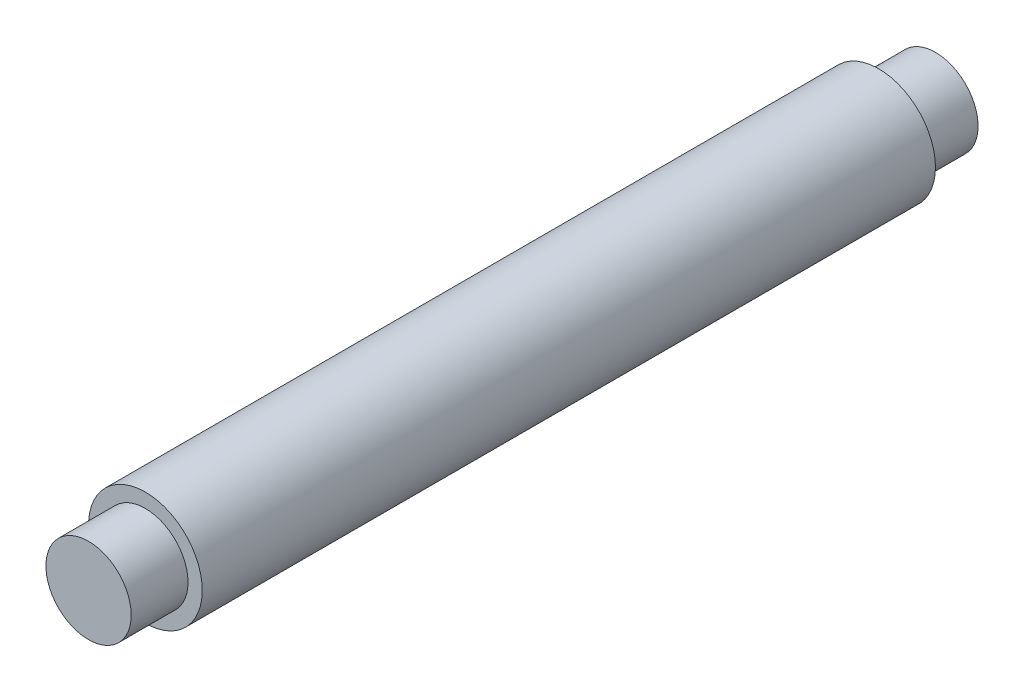
ISO-10303-21;
HEADER;
FILE_DESCRIPTION(('STEP AP214'),'2;1');
FILE_NAME('part.step','',(''),(''),'','','');
FILE_SCHEMA(('AUTOMOTIVE_DESIGN { 1 0 10303 214 1 1 1 1 }'));
ENDSEC;
DATA;
#1=APPLICATION_CONTEXT('core data for automotive mechanical design processes');
#2=APPLICATION_PROTOCOL_DEFINITION('international standard','automotive_design',2000,#1);
#3=PRODUCT_CONTEXT('',#1,'mechanical');
#4=PRODUCT('Part','Part','',(#3));
#5=PRODUCT_RELATED_PRODUCT_CATEGORY('part','',(#4));
#6=PRODUCT_DEFINITION_FORMATION('','',#4);
#7=PRODUCT_DEFINITION_CONTEXT('part definition',#1,'design');
#8=PRODUCT_DEFINITION('design','',#6,#7);
#9=PRODUCT_DEFINITION_SHAPE('','',#8);
#10=(LENGTH_UNIT() NAMED_UNIT(*) SI_UNIT(.MILLI.,.METRE.));
#11=(NAMED_UNIT(*) PLANE_ANGLE_UNIT() SI_UNIT($,.RADIAN.));
#12=(NAMED_UNIT(*) SI_UNIT($,.STERADIAN.) SOLID_ANGLE_UNIT());
#13=UNCERTAINTY_MEASURE_WITH_UNIT(LENGTH_MEASURE(1.E-05),#10,'distance_accuracy_value','');
#14=(GEOMETRIC_REPRESENTATION_CONTEXT(3) GLOBAL_UNCERTAINTY_ASSIGNED_CONTEXT((#13)) GLOBAL_UNIT_ASSIGNED_CONTEXT((#10,
#11,#12)) REPRESENTATION_CONTEXT('',''));
#15=CARTESIAN_POINT('',(0.,0.,0.));
#16=DIRECTION('',(0.,0.,1.));
#17=DIRECTION('',(1.,0.,0.));
#18=AXIS2_PLACEMENT_3D('',#15,#16,#17);
#19=CARTESIAN_POINT('',(0.,0.,258.));
#20=DIRECTION('',(0.,0.,-1.));
#21=DIRECTION('',(-1.,0.,0.));
#22=AXIS2_PLACEMENT_3D('',#19,#20,#21);
#23=CYLINDRICAL_SURFACE('',#22,20.);
#24=CARTESIAN_POINT('',(0.,0.,258.));
#25=DIRECTION('',(0.,0.,1.));
#26=DIRECTION('',(1.,0.,0.));
#27=AXIS2_PLACEMENT_3D('',#24,#25,#26);
#28=CIRCLE('',#27,20.);
#29=CARTESIAN_POINT('',(20.,0.,258.));
#30=VERTEX_POINT('',#29);
#31=EDGE_CURVE('E43',#30,#30,#28,.T.);
#32=ORIENTED_EDGE('',*,*,#31,.F.);
#33=EDGE_LOOP('',(#32));
#34=FACE_BOUND('',#33,.T.);
#35=CARTESIAN_POINT('',(0.,0.,0.));
#36=DIRECTION('',(0.,0.,1.));
#37=DIRECTION('',(1.,0.,0.));
#38=AXIS2_PLACEMENT_3D('',#35,#36,#37);
#39=CIRCLE('',#38,20.);
#40=CARTESIAN_POINT('',(20.,0.,0.));
#41=VERTEX_POINT('',#40);
#42=EDGE_CURVE('E34',#41,#41,#39,.T.);
#43=ORIENTED_EDGE('',*,*,#42,.T.);
#44=EDGE_LOOP('',(#43));
#45=FACE_BOUND('',#44,.T.);
#46=ADVANCED_FACE('F31',(#34,#45),#23,.T.);
#47=CARTESIAN_POINT('',(0.,0.,258.));
#48=DIRECTION('',(0.,0.,1.));
#49=DIRECTION('',(1.,0.,0.));
#50=AXIS2_PLACEMENT_3D('',#47,#48,#49);
#51=PLANE('',#50);
#52=CARTESIAN_POINT('',(0.,0.,258.));
#53=DIRECTION('',(0.,0.,1.));
#54=DIRECTION('',(1.,0.,0.));
#55=AXIS2_PLACEMENT_3D('',#52,#53,#54);
#56=CIRCLE('',#55,15.);
#57=CARTESIAN_POINT('',(15.,0.,258.));
#58=VERTEX_POINT('',#57);
#59=EDGE_CURVE('E38',#58,#58,#56,.T.);
#60=ORIENTED_EDGE('',*,*,#59,.F.);
#61=EDGE_LOOP('',(#60));
#62=FACE_BOUND('',#61,.T.);
#63=ORIENTED_EDGE('',*,*,#31,.T.);
#64=EDGE_LOOP('',(#63));
#65=FACE_BOUND('',#64,.T.);
#66=ADVANCED_FACE('F60',(#62,#65),#51,.T.);
#67=CARTESIAN_POINT('',(0.,0.,0.));
#68=DIRECTION('',(0.,0.,1.));
#69=DIRECTION('',(1.,0.,0.));
#70=AXIS2_PLACEMENT_3D('',#67,#68,#69);
#71=PLANE('',#70);
#72=CARTESIAN_POINT('',(0.,0.,0.));
#73=DIRECTION('',(0.,0.,-1.));
#74=DIRECTION('',(-1.,0.,0.));
#75=AXIS2_PLACEMENT_3D('',#72,#73,#74);
#76=CIRCLE('',#75,15.);
#77=CARTESIAN_POINT('',(-15.,0.,0.));
#78=VERTEX_POINT('',#77);
#79=EDGE_CURVE('E10',#78,#78,#76,.T.);
#80=ORIENTED_EDGE('',*,*,#79,.F.);
#81=EDGE_LOOP('',(#80));
#82=FACE_BOUND('',#81,.T.);
#83=ORIENTED_EDGE('',*,*,#42,.F.);
#84=EDGE_LOOP('',(#83));
#85=FACE_BOUND('',#84,.T.);
#86=ADVANCED_FACE('F57',(#82,#85),#71,.F.);
#87=CARTESIAN_POINT('',(0.,0.,278.));
#88=DIRECTION('',(0.,0.,-1.));
#89=DIRECTION('',(-1.,0.,0.));
#90=AXIS2_PLACEMENT_3D('',#87,#88,#89);
#91=CYLINDRICAL_SURFACE('',#90,15.);
#92=CARTESIAN_POINT('',(0.,0.,278.));
#93=DIRECTION('',(0.,0.,1.));
#94=DIRECTION('',(1.,0.,0.));
#95=AXIS2_PLACEMENT_3D('',#92,#93,#94);
#96=CIRCLE('',#95,15.);
#97=CARTESIAN_POINT('',(15.,0.,278.));
#98=VERTEX_POINT('',#97);
#99=EDGE_CURVE('E48',#98,#98,#96,.T.);
#100=ORIENTED_EDGE('',*,*,#99,.F.);
#101=EDGE_LOOP('',(#100));
#102=FACE_BOUND('',#101,.T.);
#103=ORIENTED_EDGE('',*,*,#59,.T.);
#104=EDGE_LOOP('',(#103));
#105=FACE_BOUND('',#104,.T.);
#106=ADVANCED_FACE('F59',(#102,#105),#91,.T.);
#107=CARTESIAN_POINT('',(0.,0.,278.));
#108=DIRECTION('',(0.,0.,1.));
#109=DIRECTION('',(1.,0.,0.));
#110=AXIS2_PLACEMENT_3D('',#107,#108,#109);
#111=PLANE('',#110);
#112=ORIENTED_EDGE('',*,*,#99,.T.);
#113=EDGE_LOOP('',(#112));
#114=FACE_BOUND('',#113,.T.);
#115=ADVANCED_FACE('F66',(#114),#111,.T.);
#116=CARTESIAN_POINT('',(0.,0.,-20.));
#117=DIRECTION('',(0.,0.,1.));
#118=DIRECTION('',(1.,0.,0.));
#119=AXIS2_PLACEMENT_3D('',#116,#117,#118);
#120=CYLINDRICAL_SURFACE('',#119,15.);
#121=CARTESIAN_POINT('',(0.,0.,-20.));
#122=DIRECTION('',(0.,0.,-1.));
#123=DIRECTION('',(-1.,0.,0.));
#124=AXIS2_PLACEMENT_3D('',#121,#122,#123);
#125=CIRCLE('',#124,15.);
#126=CARTESIAN_POINT('',(-15.,0.,-20.));
#127=VERTEX_POINT('',#126);
#128=EDGE_CURVE('E47',#127,#127,#125,.T.);
#129=ORIENTED_EDGE('',*,*,#128,.F.);
#130=EDGE_LOOP('',(#129));
#131=FACE_BOUND('',#130,.T.);
#132=ORIENTED_EDGE('',*,*,#79,.T.);
#133=EDGE_LOOP('',(#132));
#134=FACE_BOUND('',#133,.T.);
#135=ADVANCED_FACE('F94',(#131,#134),#120,.T.);
#136=CARTESIAN_POINT('',(0.,0.,-20.));
#137=DIRECTION('',(0.,0.,-1.));
#138=DIRECTION('',(-1.,0.,0.));
#139=AXIS2_PLACEMENT_3D('',#136,#137,#138);
#140=PLANE('',#139);
#141=ORIENTED_EDGE('',*,*,#128,.T.);
#142=EDGE_LOOP('',(#141));
#143=FACE_BOUND('',#142,.T.);
#144=ADVANCED_FACE('F108',(#143),#140,.T.);
#145=CLOSED_SHELL('',(#46,#66,#86,#106,#115,#135,#144));
#146=MANIFOLD_SOLID_BREP('B2',#145);
#147=ADVANCED_BREP_SHAPE_REPRESENTATION('',(#18,#146),#14);
#148=SHAPE_DEFINITION_REPRESENTATION(#9,#147);
ENDSEC;
END-ISO-10303-21;
